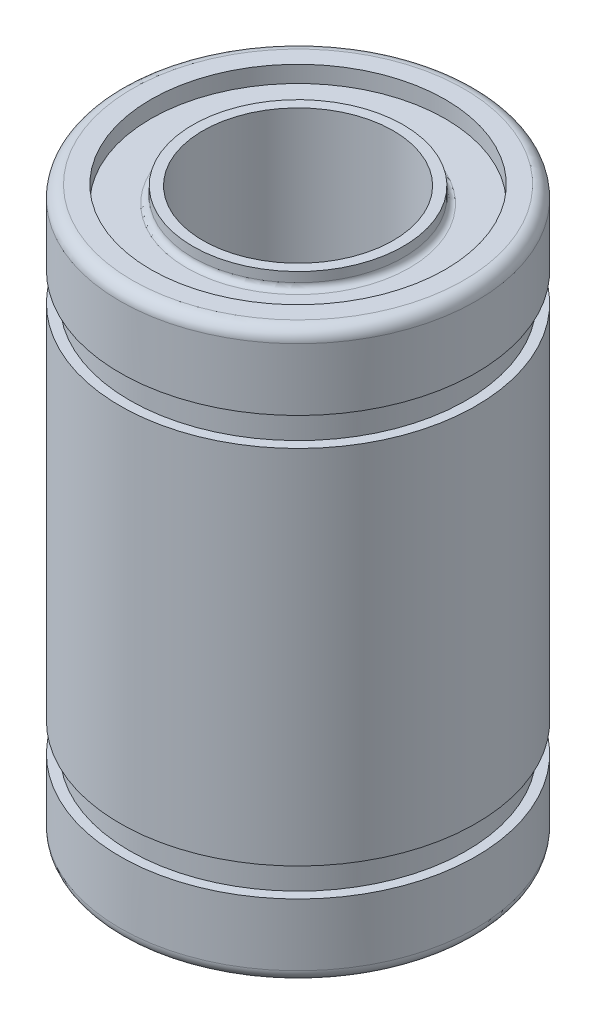
ISO-10303-21;
HEADER;
FILE_DESCRIPTION(('STEP AP214'),'2;1');
FILE_NAME('part.step','',(''),(''),'','','');
FILE_SCHEMA(('AUTOMOTIVE_DESIGN { 1 0 10303 214 1 1 1 1 }'));
ENDSEC;
DATA;
#1=APPLICATION_CONTEXT('core data for automotive mechanical design processes');
#2=APPLICATION_PROTOCOL_DEFINITION('international standard','automotive_design',2000,#1);
#3=PRODUCT_CONTEXT('',#1,'mechanical');
#4=PRODUCT('Part','Part','',(#3));
#5=PRODUCT_RELATED_PRODUCT_CATEGORY('part','',(#4));
#6=PRODUCT_DEFINITION_FORMATION('','',#4);
#7=PRODUCT_DEFINITION_CONTEXT('part definition',#1,'design');
#8=PRODUCT_DEFINITION('design','',#6,#7);
#9=PRODUCT_DEFINITION_SHAPE('','',#8);
#10=(LENGTH_UNIT() NAMED_UNIT(*) SI_UNIT(.MILLI.,.METRE.));
#11=(NAMED_UNIT(*) PLANE_ANGLE_UNIT() SI_UNIT($,.RADIAN.));
#12=(NAMED_UNIT(*) SI_UNIT($,.STERADIAN.) SOLID_ANGLE_UNIT());
#13=UNCERTAINTY_MEASURE_WITH_UNIT(LENGTH_MEASURE(1.E-05),#10,'distance_accuracy_value','');
#14=(GEOMETRIC_REPRESENTATION_CONTEXT(3) GLOBAL_UNCERTAINTY_ASSIGNED_CONTEXT((#13)) GLOBAL_UNIT_ASSIGNED_CONTEXT((#10,
#11,#12)) REPRESENTATION_CONTEXT('',''));
#15=CARTESIAN_POINT('',(0.,0.,0.));
#16=DIRECTION('',(0.,0.,1.));
#17=DIRECTION('',(1.,0.,0.));
#18=AXIS2_PLACEMENT_3D('',#15,#16,#17);
#19=CARTESIAN_POINT('',(0.,11.9199999999999,0.));
#20=DIRECTION('',(0.,-1.,0.));
#21=DIRECTION('',(0.,0.,-1.));
#22=AXIS2_PLACEMENT_3D('',#19,#20,#21);
#23=CYLINDRICAL_SURFACE('',#22,4.);
#24=CARTESIAN_POINT('',(0.,-11.8803999999999,0.));
#25=DIRECTION('',(0.,-1.,0.));
#26=DIRECTION('',(0.,0.,-1.));
#27=AXIS2_PLACEMENT_3D('',#24,#25,#26);
#28=CIRCLE('',#27,4.);
#29=CARTESIAN_POINT('',(0.,-11.8803999999999,-4.));
#30=VERTEX_POINT('',#29);
#31=EDGE_CURVE('E80',#30,#30,#28,.F.);
#32=ORIENTED_EDGE('',*,*,#31,.F.);
#33=EDGE_LOOP('',(#32));
#34=FACE_BOUND('',#33,.T.);
#35=CARTESIAN_POINT('',(0.,11.8803999999999,0.));
#36=DIRECTION('',(0.,-1.,0.));
#37=DIRECTION('',(0.,0.,-1.));
#38=AXIS2_PLACEMENT_3D('',#35,#36,#37);
#39=CIRCLE('',#38,4.);
#40=CARTESIAN_POINT('',(0.,11.8803999999999,-4.));
#41=VERTEX_POINT('',#40);
#42=EDGE_CURVE('E25',#41,#41,#39,.T.);
#43=ORIENTED_EDGE('',*,*,#42,.F.);
#44=EDGE_LOOP('',(#43));
#45=FACE_BOUND('',#44,.T.);
#46=ADVANCED_FACE('F22',(#34,#45),#23,.F.);
#47=CARTESIAN_POINT('',(0.,11.8803999999999,0.));
#48=DIRECTION('',(0.,1.,0.));
#49=DIRECTION('',(0.,0.,1.));
#50=AXIS2_PLACEMENT_3D('',#47,#48,#49);
#51=PLANE('',#50);
#52=ORIENTED_EDGE('',*,*,#42,.T.);
#53=EDGE_LOOP('',(#52));
#54=FACE_BOUND('',#53,.T.);
#55=CARTESIAN_POINT('',(0.,11.8803999999999,0.));
#56=DIRECTION('',(0.,-1.,0.));
#57=DIRECTION('',(0.,0.,-1.));
#58=AXIS2_PLACEMENT_3D('',#55,#56,#57);
#59=CIRCLE('',#58,4.425);
#60=CARTESIAN_POINT('',(0.,11.8803999999999,-4.425));
#61=VERTEX_POINT('',#60);
#62=EDGE_CURVE('E78',#61,#61,#59,.T.);
#63=ORIENTED_EDGE('',*,*,#62,.F.);
#64=EDGE_LOOP('',(#63));
#65=FACE_BOUND('',#64,.T.);
#66=ADVANCED_FACE('F87',(#54,#65),#51,.T.);
#67=CARTESIAN_POINT('',(0.,-11.8803999999999,0.));
#68=DIRECTION('',(0.,-1.,0.));
#69=DIRECTION('',(0.,0.,-1.));
#70=AXIS2_PLACEMENT_3D('',#67,#68,#69);
#71=PLANE('',#70);
#72=ORIENTED_EDGE('',*,*,#31,.T.);
#73=EDGE_LOOP('',(#72));
#74=FACE_BOUND('',#73,.T.);
#75=CARTESIAN_POINT('',(0.,-11.8803999999999,0.));
#76=DIRECTION('',(0.,1.,0.));
#77=DIRECTION('',(0.,0.,1.));
#78=AXIS2_PLACEMENT_3D('',#75,#76,#77);
#79=CIRCLE('',#78,4.425);
#80=CARTESIAN_POINT('',(0.,-11.8803999999999,4.425));
#81=VERTEX_POINT('',#80);
#82=EDGE_CURVE('E74',#81,#81,#79,.T.);
#83=ORIENTED_EDGE('',*,*,#82,.F.);
#84=EDGE_LOOP('',(#83));
#85=FACE_BOUND('',#84,.T.);
#86=ADVANCED_FACE('F96',(#74,#85),#71,.T.);
#87=CARTESIAN_POINT('',(0.,11.8803999999999,0.));
#88=DIRECTION('',(0.,-1.,0.));
#89=DIRECTION('',(0.,0.,-1.));
#90=AXIS2_PLACEMENT_3D('',#87,#88,#89);
#91=CYLINDRICAL_SURFACE('',#90,4.425);
#92=CARTESIAN_POINT('',(0.,11.4739999999998,0.));
#93=DIRECTION('',(0.,1.,0.));
#94=DIRECTION('',(0.,0.,1.));
#95=AXIS2_PLACEMENT_3D('',#92,#93,#94);
#96=CIRCLE('',#95,4.425);
#97=CARTESIAN_POINT('',(0.,11.4739999999998,4.425));
#98=VERTEX_POINT('',#97);
#99=EDGE_CURVE('E77',#98,#98,#96,.T.);
#100=ORIENTED_EDGE('',*,*,#99,.T.);
#101=EDGE_LOOP('',(#100));
#102=FACE_BOUND('',#101,.T.);
#103=ORIENTED_EDGE('',*,*,#62,.T.);
#104=EDGE_LOOP('',(#103));
#105=FACE_BOUND('',#104,.T.);
#106=ADVANCED_FACE('F264',(#102,#105),#91,.T.);
#107=CARTESIAN_POINT('',(0.,-11.8803999999999,0.));
#108=DIRECTION('',(0.,1.,0.));
#109=DIRECTION('',(0.,0.,1.));
#110=AXIS2_PLACEMENT_3D('',#107,#108,#109);
#111=CYLINDRICAL_SURFACE('',#110,4.425);
#112=CARTESIAN_POINT('',(0.,-11.4739999999998,0.));
#113=DIRECTION('',(0.,-1.,0.));
#114=DIRECTION('',(0.,0.,-1.));
#115=AXIS2_PLACEMENT_3D('',#112,#113,#114);
#116=CIRCLE('',#115,4.425);
#117=CARTESIAN_POINT('',(0.,-11.4739999999998,-4.425));
#118=VERTEX_POINT('',#117);
#119=EDGE_CURVE('E237',#118,#118,#116,.T.);
#120=ORIENTED_EDGE('',*,*,#119,.T.);
#121=EDGE_LOOP('',(#120));
#122=FACE_BOUND('',#121,.T.);
#123=ORIENTED_EDGE('',*,*,#82,.T.);
#124=EDGE_LOOP('',(#123));
#125=FACE_BOUND('',#124,.T.);
#126=ADVANCED_FACE('F260',(#122,#125),#111,.T.);
#127=CARTESIAN_POINT('',(0.,11.4739999999998,0.));
#128=DIRECTION('',(0.,1.,0.));
#129=DIRECTION('',(0.,0.,1.));
#130=AXIS2_PLACEMENT_3D('',#127,#128,#129);
#131=TOROIDAL_SURFACE('',#130,4.67899999999988,0.254);
#132=CARTESIAN_POINT('',(0.,11.2199999999998,0.));
#133=DIRECTION('',(0.,1.,0.));
#134=DIRECTION('',(0.,0.,1.));
#135=AXIS2_PLACEMENT_3D('',#132,#133,#134);
#136=CIRCLE('',#135,4.67899999999988);
#137=CARTESIAN_POINT('',(0.,11.2199999999998,4.67899999999988));
#138=VERTEX_POINT('',#137);
#139=EDGE_CURVE('E240',#138,#138,#136,.F.);
#140=ORIENTED_EDGE('',*,*,#139,.F.);
#141=EDGE_LOOP('',(#140));
#142=FACE_BOUND('',#141,.T.);
#143=ORIENTED_EDGE('',*,*,#99,.F.);
#144=EDGE_LOOP('',(#143));
#145=FACE_BOUND('',#144,.T.);
#146=ADVANCED_FACE('F256',(#142,#145),#131,.F.);
#147=CARTESIAN_POINT('',(0.,-11.4739999999998,0.));
#148=DIRECTION('',(0.,-1.,0.));
#149=DIRECTION('',(0.,0.,-1.));
#150=AXIS2_PLACEMENT_3D('',#147,#148,#149);
#151=TOROIDAL_SURFACE('',#150,4.67899999999988,0.254);
#152=CARTESIAN_POINT('',(0.,-11.2199999999998,0.));
#153=DIRECTION('',(0.,-1.,0.));
#154=DIRECTION('',(0.,0.,-1.));
#155=AXIS2_PLACEMENT_3D('',#152,#153,#154);
#156=CIRCLE('',#155,4.67899999999988);
#157=CARTESIAN_POINT('',(0.,-11.2199999999998,-4.67899999999988));
#158=VERTEX_POINT('',#157);
#159=EDGE_CURVE('E73',#158,#158,#156,.F.);
#160=ORIENTED_EDGE('',*,*,#159,.F.);
#161=EDGE_LOOP('',(#160));
#162=FACE_BOUND('',#161,.T.);
#163=ORIENTED_EDGE('',*,*,#119,.F.);
#164=EDGE_LOOP('',(#163));
#165=FACE_BOUND('',#164,.T.);
#166=ADVANCED_FACE('F224',(#162,#165),#151,.F.);
#167=CARTESIAN_POINT('',(0.,11.2199999999998,0.));
#168=DIRECTION('',(0.,1.,0.));
#169=DIRECTION('',(0.,0.,1.));
#170=AXIS2_PLACEMENT_3D('',#167,#168,#169);
#171=PLANE('',#170);
#172=ORIENTED_EDGE('',*,*,#139,.T.);
#173=EDGE_LOOP('',(#172));
#174=FACE_BOUND('',#173,.T.);
#175=CARTESIAN_POINT('',(0.,11.2199999999998,0.));
#176=DIRECTION('',(0.,1.,0.));
#177=DIRECTION('',(0.,0.,1.));
#178=AXIS2_PLACEMENT_3D('',#175,#176,#177);
#179=CIRCLE('',#178,6.19);
#180=CARTESIAN_POINT('',(0.,11.2199999999998,6.19));
#181=VERTEX_POINT('',#180);
#182=EDGE_CURVE('E70',#181,#181,#179,.T.);
#183=ORIENTED_EDGE('',*,*,#182,.T.);
#184=EDGE_LOOP('',(#183));
#185=FACE_BOUND('',#184,.T.);
#186=ADVANCED_FACE('F220',(#174,#185),#171,.T.);
#187=CARTESIAN_POINT('',(0.,-11.2199999999998,0.));
#188=DIRECTION('',(0.,-1.,0.));
#189=DIRECTION('',(0.,0.,-1.));
#190=AXIS2_PLACEMENT_3D('',#187,#188,#189);
#191=PLANE('',#190);
#192=ORIENTED_EDGE('',*,*,#159,.T.);
#193=EDGE_LOOP('',(#192));
#194=FACE_BOUND('',#193,.T.);
#195=CARTESIAN_POINT('',(0.,-11.2199999999998,0.));
#196=DIRECTION('',(0.,-1.,0.));
#197=DIRECTION('',(0.,0.,-1.));
#198=AXIS2_PLACEMENT_3D('',#195,#196,#197);
#199=CIRCLE('',#198,6.19);
#200=CARTESIAN_POINT('',(0.,-11.2199999999998,-6.19));
#201=VERTEX_POINT('',#200);
#202=EDGE_CURVE('E67',#201,#201,#199,.T.);
#203=ORIENTED_EDGE('',*,*,#202,.T.);
#204=EDGE_LOOP('',(#203));
#205=FACE_BOUND('',#204,.T.);
#206=ADVANCED_FACE('F210',(#194,#205),#191,.T.);
#207=CARTESIAN_POINT('',(0.,11.2199999999998,0.));
#208=DIRECTION('',(0.,1.,0.));
#209=DIRECTION('',(0.,0.,1.));
#210=AXIS2_PLACEMENT_3D('',#207,#208,#209);
#211=CYLINDRICAL_SURFACE('',#210,6.19);
#212=CARTESIAN_POINT('',(0.,11.9199999999999,0.));
#213=DIRECTION('',(0.,1.,0.));
#214=DIRECTION('',(0.,0.,1.));
#215=AXIS2_PLACEMENT_3D('',#212,#213,#214);
#216=CIRCLE('',#215,6.19);
#217=CARTESIAN_POINT('',(0.,11.9199999999999,6.19));
#218=VERTEX_POINT('',#217);
#219=EDGE_CURVE('E64',#218,#218,#216,.F.);
#220=ORIENTED_EDGE('',*,*,#219,.F.);
#221=EDGE_LOOP('',(#220));
#222=FACE_BOUND('',#221,.T.);
#223=ORIENTED_EDGE('',*,*,#182,.F.);
#224=EDGE_LOOP('',(#223));
#225=FACE_BOUND('',#224,.T.);
#226=ADVANCED_FACE('F219',(#222,#225),#211,.F.);
#227=CARTESIAN_POINT('',(0.,-11.2199999999998,0.));
#228=DIRECTION('',(0.,-1.,0.));
#229=DIRECTION('',(0.,0.,-1.));
#230=AXIS2_PLACEMENT_3D('',#227,#228,#229);
#231=CYLINDRICAL_SURFACE('',#230,6.19);
#232=CARTESIAN_POINT('',(0.,-11.9199999999999,0.));
#233=DIRECTION('',(0.,-1.,0.));
#234=DIRECTION('',(0.,0.,-1.));
#235=AXIS2_PLACEMENT_3D('',#232,#233,#234);
#236=CIRCLE('',#235,6.19);
#237=CARTESIAN_POINT('',(0.,-11.9199999999999,-6.19));
#238=VERTEX_POINT('',#237);
#239=EDGE_CURVE('E60',#238,#238,#236,.T.);
#240=ORIENTED_EDGE('',*,*,#239,.T.);
#241=EDGE_LOOP('',(#240));
#242=FACE_BOUND('',#241,.T.);
#243=ORIENTED_EDGE('',*,*,#202,.F.);
#244=EDGE_LOOP('',(#243));
#245=FACE_BOUND('',#244,.T.);
#246=ADVANCED_FACE('F175',(#242,#245),#231,.F.);
#247=CARTESIAN_POINT('',(0.,11.9199999999999,0.));
#248=DIRECTION('',(0.,1.,0.));
#249=DIRECTION('',(0.,0.,1.));
#250=AXIS2_PLACEMENT_3D('',#247,#248,#249);
#251=PLANE('',#250);
#252=ORIENTED_EDGE('',*,*,#219,.T.);
#253=EDGE_LOOP('',(#252));
#254=FACE_BOUND('',#253,.T.);
#255=CARTESIAN_POINT('',(0.,11.92,0.));
#256=DIRECTION('',(0.,-1.,0.));
#257=DIRECTION('',(0.,0.,1.));
#258=AXIS2_PLACEMENT_3D('',#255,#256,#257);
#259=CIRCLE('',#258,6.9720000000002);
#260=CARTESIAN_POINT('',(0.,11.92,6.9720000000002));
#261=VERTEX_POINT('',#260);
#262=EDGE_CURVE('E63',#261,#261,#259,.T.);
#263=ORIENTED_EDGE('',*,*,#262,.F.);
#264=EDGE_LOOP('',(#263));
#265=FACE_BOUND('',#264,.T.);
#266=ADVANCED_FACE('F170',(#254,#265),#251,.T.);
#267=CARTESIAN_POINT('',(0.,-11.9199999999999,0.));
#268=DIRECTION('',(0.,1.,0.));
#269=DIRECTION('',(0.,0.,1.));
#270=AXIS2_PLACEMENT_3D('',#267,#268,#269);
#271=PLANE('',#270);
#272=ORIENTED_EDGE('',*,*,#239,.F.);
#273=EDGE_LOOP('',(#272));
#274=FACE_BOUND('',#273,.T.);
#275=CARTESIAN_POINT('',(0.,-11.92,0.));
#276=DIRECTION('',(0.,1.,0.));
#277=DIRECTION('',(0.,0.,1.));
#278=AXIS2_PLACEMENT_3D('',#275,#276,#277);
#279=CIRCLE('',#278,6.9720000000002);
#280=CARTESIAN_POINT('',(0.,-11.92,6.9720000000002));
#281=VERTEX_POINT('',#280);
#282=EDGE_CURVE('E157',#281,#281,#279,.T.);
#283=ORIENTED_EDGE('',*,*,#282,.F.);
#284=EDGE_LOOP('',(#283));
#285=FACE_BOUND('',#284,.T.);
#286=ADVANCED_FACE('F161',(#274,#285),#271,.F.);
#287=CARTESIAN_POINT('',(0.,11.412,0.));
#288=DIRECTION('',(0.,1.,0.));
#289=DIRECTION('',(0.,0.,1.));
#290=AXIS2_PLACEMENT_3D('',#287,#288,#289);
#291=TOROIDAL_SURFACE('',#290,6.9720000000002,0.508);
#292=ORIENTED_EDGE('',*,*,#262,.T.);
#293=EDGE_LOOP('',(#292));
#294=FACE_BOUND('',#293,.T.);
#295=CARTESIAN_POINT('',(0.,11.412,0.));
#296=DIRECTION('',(0.,-1.,0.));
#297=DIRECTION('',(0.,0.,-1.));
#298=AXIS2_PLACEMENT_3D('',#295,#296,#297);
#299=CIRCLE('',#298,7.48);
#300=CARTESIAN_POINT('',(0.,11.412,-7.48));
#301=VERTEX_POINT('',#300);
#302=EDGE_CURVE('E374',#301,#301,#299,.T.);
#303=ORIENTED_EDGE('',*,*,#302,.F.);
#304=EDGE_LOOP('',(#303));
#305=FACE_BOUND('',#304,.T.);
#306=ADVANCED_FACE('F141',(#294,#305),#291,.T.);
#307=CARTESIAN_POINT('',(0.,-11.412,0.));
#308=DIRECTION('',(0.,1.,0.));
#309=DIRECTION('',(0.,0.,1.));
#310=AXIS2_PLACEMENT_3D('',#307,#308,#309);
#311=TOROIDAL_SURFACE('',#310,6.9720000000002,0.508);
#312=CARTESIAN_POINT('',(0.,-11.412,0.));
#313=DIRECTION('',(0.,-1.,0.));
#314=DIRECTION('',(0.,0.,-1.));
#315=AXIS2_PLACEMENT_3D('',#312,#313,#314);
#316=CIRCLE('',#315,7.48);
#317=CARTESIAN_POINT('',(0.,-11.412,-7.48));
#318=VERTEX_POINT('',#317);
#319=EDGE_CURVE('E59',#318,#318,#316,.F.);
#320=ORIENTED_EDGE('',*,*,#319,.F.);
#321=EDGE_LOOP('',(#320));
#322=FACE_BOUND('',#321,.T.);
#323=ORIENTED_EDGE('',*,*,#282,.T.);
#324=EDGE_LOOP('',(#323));
#325=FACE_BOUND('',#324,.T.);
#326=ADVANCED_FACE('F135',(#322,#325),#311,.T.);
#327=CARTESIAN_POINT('',(0.,11.9199999999999,0.));
#328=DIRECTION('',(0.,-1.,0.));
#329=DIRECTION('',(0.,0.,-1.));
#330=AXIS2_PLACEMENT_3D('',#327,#328,#329);
#331=CYLINDRICAL_SURFACE('',#330,7.48);
#332=CARTESIAN_POINT('',(0.,8.79999999999992,0.));
#333=DIRECTION('',(0.,-1.,0.));
#334=DIRECTION('',(0.,0.,-1.));
#335=AXIS2_PLACEMENT_3D('',#332,#333,#334);
#336=CIRCLE('',#335,7.48);
#337=CARTESIAN_POINT('',(0.,8.79999999999992,-7.48));
#338=VERTEX_POINT('',#337);
#339=EDGE_CURVE('E56',#338,#338,#336,.T.);
#340=ORIENTED_EDGE('',*,*,#339,.F.);
#341=EDGE_LOOP('',(#340));
#342=FACE_BOUND('',#341,.T.);
#343=ORIENTED_EDGE('',*,*,#302,.T.);
#344=EDGE_LOOP('',(#343));
#345=FACE_BOUND('',#344,.T.);
#346=ADVANCED_FACE('F131',(#342,#345),#331,.T.);
#347=CARTESIAN_POINT('',(0.,11.9199999999999,0.));
#348=DIRECTION('',(0.,-1.,0.));
#349=DIRECTION('',(0.,0.,-1.));
#350=AXIS2_PLACEMENT_3D('',#347,#348,#349);
#351=CYLINDRICAL_SURFACE('',#350,7.48);
#352=ORIENTED_EDGE('',*,*,#319,.T.);
#353=EDGE_LOOP('',(#352));
#354=FACE_BOUND('',#353,.T.);
#355=CARTESIAN_POINT('',(0.,-8.79999999999992,0.));
#356=DIRECTION('',(0.,-1.,0.));
#357=DIRECTION('',(0.,0.,-1.));
#358=AXIS2_PLACEMENT_3D('',#355,#356,#357);
#359=CIRCLE('',#358,7.48);
#360=CARTESIAN_POINT('',(0.,-8.79999999999992,-7.48));
#361=VERTEX_POINT('',#360);
#362=EDGE_CURVE('E53',#361,#361,#359,.F.);
#363=ORIENTED_EDGE('',*,*,#362,.F.);
#364=EDGE_LOOP('',(#363));
#365=FACE_BOUND('',#364,.T.);
#366=ADVANCED_FACE('F127',(#354,#365),#351,.T.);
#367=CARTESIAN_POINT('',(7.075,8.79999999999992,0.));
#368=DIRECTION('',(0.,-1.,0.));
#369=DIRECTION('',(0.,0.,-1.));
#370=AXIS2_PLACEMENT_3D('',#367,#368,#369);
#371=PLANE('',#370);
#372=CARTESIAN_POINT('',(0.,8.79999999999992,0.));
#373=DIRECTION('',(0.,1.,0.));
#374=DIRECTION('',(0.,0.,1.));
#375=AXIS2_PLACEMENT_3D('',#372,#373,#374);
#376=CIRCLE('',#375,7.075);
#377=CARTESIAN_POINT('',(0.,8.79999999999992,7.075));
#378=VERTEX_POINT('',#377);
#379=EDGE_CURVE('E50',#378,#378,#376,.F.);
#380=ORIENTED_EDGE('',*,*,#379,.F.);
#381=EDGE_LOOP('',(#380));
#382=FACE_BOUND('',#381,.T.);
#383=ORIENTED_EDGE('',*,*,#339,.T.);
#384=EDGE_LOOP('',(#383));
#385=FACE_BOUND('',#384,.T.);
#386=ADVANCED_FACE('F123',(#382,#385),#371,.T.);
#387=CARTESIAN_POINT('',(7.075,-8.79999999999992,0.));
#388=DIRECTION('',(0.,1.,0.));
#389=DIRECTION('',(0.,0.,1.));
#390=AXIS2_PLACEMENT_3D('',#387,#388,#389);
#391=PLANE('',#390);
#392=CARTESIAN_POINT('',(0.,-8.79999999999992,0.));
#393=DIRECTION('',(0.,1.,0.));
#394=DIRECTION('',(0.,0.,1.));
#395=AXIS2_PLACEMENT_3D('',#392,#393,#394);
#396=CIRCLE('',#395,7.075);
#397=CARTESIAN_POINT('',(0.,-8.79999999999992,7.075));
#398=VERTEX_POINT('',#397);
#399=EDGE_CURVE('E47',#398,#398,#396,.T.);
#400=ORIENTED_EDGE('',*,*,#399,.F.);
#401=EDGE_LOOP('',(#400));
#402=FACE_BOUND('',#401,.T.);
#403=ORIENTED_EDGE('',*,*,#362,.T.);
#404=EDGE_LOOP('',(#403));
#405=FACE_BOUND('',#404,.T.);
#406=ADVANCED_FACE('F119',(#402,#405),#391,.T.);
#407=CARTESIAN_POINT('',(0.,23.8399999999999,0.));
#408=DIRECTION('',(0.,1.,0.));
#409=DIRECTION('',(0.,0.,1.));
#410=AXIS2_PLACEMENT_3D('',#407,#408,#409);
#411=CYLINDRICAL_SURFACE('',#410,7.075);
#412=ORIENTED_EDGE('',*,*,#379,.T.);
#413=EDGE_LOOP('',(#412));
#414=FACE_BOUND('',#413,.T.);
#415=CARTESIAN_POINT('',(0.,7.60000000000005,0.));
#416=DIRECTION('',(0.,1.,0.));
#417=DIRECTION('',(0.,0.,1.));
#418=AXIS2_PLACEMENT_3D('',#415,#416,#417);
#419=CIRCLE('',#418,7.075);
#420=CARTESIAN_POINT('',(0.,7.60000000000005,7.075));
#421=VERTEX_POINT('',#420);
#422=EDGE_CURVE('E44',#421,#421,#419,.F.);
#423=ORIENTED_EDGE('',*,*,#422,.F.);
#424=EDGE_LOOP('',(#423));
#425=FACE_BOUND('',#424,.T.);
#426=ADVANCED_FACE('F115',(#414,#425),#411,.T.);
#427=CARTESIAN_POINT('',(0.,23.8399999999999,0.));
#428=DIRECTION('',(0.,1.,0.));
#429=DIRECTION('',(0.,0.,1.));
#430=AXIS2_PLACEMENT_3D('',#427,#428,#429);
#431=CYLINDRICAL_SURFACE('',#430,7.075);
#432=CARTESIAN_POINT('',(0.,-7.60000000000005,0.));
#433=DIRECTION('',(0.,1.,0.));
#434=DIRECTION('',(0.,0.,1.));
#435=AXIS2_PLACEMENT_3D('',#432,#433,#434);
#436=CIRCLE('',#435,7.075);
#437=CARTESIAN_POINT('',(0.,-7.60000000000005,7.075));
#438=VERTEX_POINT('',#437);
#439=EDGE_CURVE('E34',#438,#438,#436,.T.);
#440=ORIENTED_EDGE('',*,*,#439,.F.);
#441=EDGE_LOOP('',(#440));
#442=FACE_BOUND('',#441,.T.);
#443=ORIENTED_EDGE('',*,*,#399,.T.);
#444=EDGE_LOOP('',(#443));
#445=FACE_BOUND('',#444,.T.);
#446=ADVANCED_FACE('F111',(#442,#445),#431,.T.);
#447=CARTESIAN_POINT('',(7.075,7.60000000000005,0.));
#448=DIRECTION('',(0.,1.,0.));
#449=DIRECTION('',(0.,0.,1.));
#450=AXIS2_PLACEMENT_3D('',#447,#448,#449);
#451=PLANE('',#450);
#452=ORIENTED_EDGE('',*,*,#422,.T.);
#453=EDGE_LOOP('',(#452));
#454=FACE_BOUND('',#453,.T.);
#455=CARTESIAN_POINT('',(0.,7.60000000000005,0.));
#456=DIRECTION('',(0.,-1.,0.));
#457=DIRECTION('',(0.,0.,-1.));
#458=AXIS2_PLACEMENT_3D('',#455,#456,#457);
#459=CIRCLE('',#458,7.48);
#460=CARTESIAN_POINT('',(0.,7.60000000000005,-7.48));
#461=VERTEX_POINT('',#460);
#462=EDGE_CURVE('E29',#461,#461,#459,.T.);
#463=ORIENTED_EDGE('',*,*,#462,.F.);
#464=EDGE_LOOP('',(#463));
#465=FACE_BOUND('',#464,.T.);
#466=ADVANCED_FACE('F104',(#454,#465),#451,.T.);
#467=CARTESIAN_POINT('',(7.075,-7.60000000000005,0.));
#468=DIRECTION('',(0.,-1.,0.));
#469=DIRECTION('',(0.,0.,-1.));
#470=AXIS2_PLACEMENT_3D('',#467,#468,#469);
#471=PLANE('',#470);
#472=ORIENTED_EDGE('',*,*,#439,.T.);
#473=EDGE_LOOP('',(#472));
#474=FACE_BOUND('',#473,.T.);
#475=CARTESIAN_POINT('',(0.,-7.60000000000005,0.));
#476=DIRECTION('',(0.,-1.,0.));
#477=DIRECTION('',(0.,0.,-1.));
#478=AXIS2_PLACEMENT_3D('',#475,#476,#477);
#479=CIRCLE('',#478,7.48);
#480=CARTESIAN_POINT('',(0.,-7.60000000000005,-7.48));
#481=VERTEX_POINT('',#480);
#482=EDGE_CURVE('E12',#481,#481,#479,.F.);
#483=ORIENTED_EDGE('',*,*,#482,.F.);
#484=EDGE_LOOP('',(#483));
#485=FACE_BOUND('',#484,.T.);
#486=ADVANCED_FACE('F99',(#474,#485),#471,.T.);
#487=CARTESIAN_POINT('',(0.,11.9199999999999,0.));
#488=DIRECTION('',(0.,-1.,0.));
#489=DIRECTION('',(0.,0.,-1.));
#490=AXIS2_PLACEMENT_3D('',#487,#488,#489);
#491=CYLINDRICAL_SURFACE('',#490,7.48);
#492=ORIENTED_EDGE('',*,*,#482,.T.);
#493=EDGE_LOOP('',(#492));
#494=FACE_BOUND('',#493,.T.);
#495=ORIENTED_EDGE('',*,*,#462,.T.);
#496=EDGE_LOOP('',(#495));
#497=FACE_BOUND('',#496,.T.);
#498=ADVANCED_FACE('F97',(#494,#497),#491,.T.);
#499=CLOSED_SHELL('',(#46,#66,#86,#106,#126,#146,#166,#186,#206,#226,#246,#266,#286,#306,#326,
#346,#366,#386,#406,#426,#446,#466,#486,#498));
#500=MANIFOLD_SOLID_BREP('B1',#499);
#501=ADVANCED_BREP_SHAPE_REPRESENTATION('',(#18,#500),#14);
#502=SHAPE_DEFINITION_REPRESENTATION(#9,#501);
ENDSEC;
END-ISO-10303-21;
